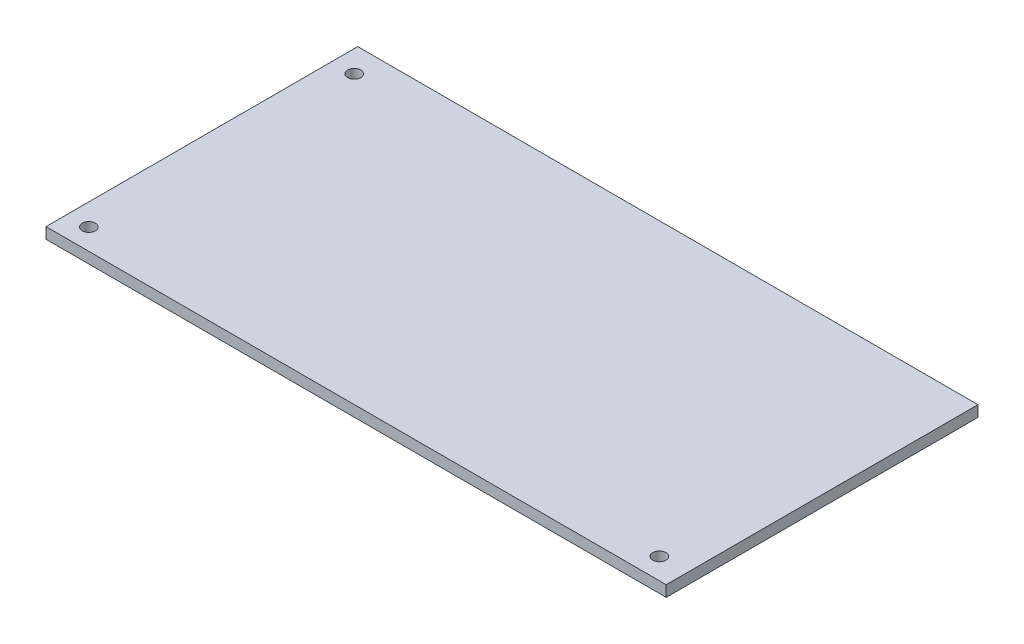
ISO-10303-21;
HEADER;
FILE_DESCRIPTION(('STEP AP214'),'2;1');
FILE_NAME('part.step','',(''),(''),'','','');
FILE_SCHEMA(('AUTOMOTIVE_DESIGN { 1 0 10303 214 1 1 1 1 }'));
ENDSEC;
DATA;
#1=APPLICATION_CONTEXT('core data for automotive mechanical design processes');
#2=APPLICATION_PROTOCOL_DEFINITION('international standard','automotive_design',2000,#1);
#3=PRODUCT_CONTEXT('',#1,'mechanical');
#4=PRODUCT('Part','Part','',(#3));
#5=PRODUCT_RELATED_PRODUCT_CATEGORY('part','',(#4));
#6=PRODUCT_DEFINITION_FORMATION('','',#4);
#7=PRODUCT_DEFINITION_CONTEXT('part definition',#1,'design');
#8=PRODUCT_DEFINITION('design','',#6,#7);
#9=PRODUCT_DEFINITION_SHAPE('','',#8);
#10=(LENGTH_UNIT() NAMED_UNIT(*) SI_UNIT(.MILLI.,.METRE.));
#11=(NAMED_UNIT(*) PLANE_ANGLE_UNIT() SI_UNIT($,.RADIAN.));
#12=(NAMED_UNIT(*) SI_UNIT($,.STERADIAN.) SOLID_ANGLE_UNIT());
#13=UNCERTAINTY_MEASURE_WITH_UNIT(LENGTH_MEASURE(1.E-05),#10,'distance_accuracy_value','');
#14=(GEOMETRIC_REPRESENTATION_CONTEXT(3) GLOBAL_UNCERTAINTY_ASSIGNED_CONTEXT((#13)) GLOBAL_UNIT_ASSIGNED_CONTEXT((#10,
#11,#12)) REPRESENTATION_CONTEXT('',''));
#15=CARTESIAN_POINT('',(0.,0.,0.));
#16=DIRECTION('',(0.,0.,1.));
#17=DIRECTION('',(1.,0.,0.));
#18=AXIS2_PLACEMENT_3D('',#15,#16,#17);
#19=CARTESIAN_POINT('',(0.,1.66,0.));
#20=DIRECTION('',(1.,0.,0.));
#21=DIRECTION('',(0.,0.,-1.));
#22=AXIS2_PLACEMENT_3D('',#19,#20,#21);
#23=PLANE('',#22);
#24=DIRECTION('',(0.,0.,1.));
#25=VECTOR('',#24,1.);
#26=CARTESIAN_POINT('',(0.,0.,0.));
#27=LINE('',#26,#25);
#28=CARTESIAN_POINT('',(0.,0.,-47.));
#29=VERTEX_POINT('',#28);
#30=CARTESIAN_POINT('',(0.,0.,0.));
#31=VERTEX_POINT('',#30);
#32=EDGE_CURVE('E97',#29,#31,#27,.T.);
#33=ORIENTED_EDGE('',*,*,#32,.T.);
#34=DIRECTION('',(0.,-1.,0.));
#35=VECTOR('',#34,1.);
#36=CARTESIAN_POINT('',(0.,1.66,0.));
#37=LINE('',#36,#35);
#38=CARTESIAN_POINT('',(0.,1.66,0.));
#39=VERTEX_POINT('',#38);
#40=EDGE_CURVE('E11',#39,#31,#37,.T.);
#41=ORIENTED_EDGE('',*,*,#40,.F.);
#42=DIRECTION('',(0.,0.,1.));
#43=VECTOR('',#42,1.);
#44=CARTESIAN_POINT('',(0.,1.66,0.));
#45=LINE('',#44,#43);
#46=CARTESIAN_POINT('',(0.,1.66,-47.));
#47=VERTEX_POINT('',#46);
#48=EDGE_CURVE('E85',#47,#39,#45,.T.);
#49=ORIENTED_EDGE('',*,*,#48,.F.);
#50=DIRECTION('',(0.,-1.,0.));
#51=VECTOR('',#50,1.);
#52=CARTESIAN_POINT('',(0.,1.66,-47.));
#53=LINE('',#52,#51);
#54=EDGE_CURVE('E93',#47,#29,#53,.T.);
#55=ORIENTED_EDGE('',*,*,#54,.T.);
#56=EDGE_LOOP('',(#33,#41,#49,#55));
#57=FACE_BOUND('',#56,.T.);
#58=ADVANCED_FACE('F34',(#57),#23,.F.);
#59=CARTESIAN_POINT('',(0.,1.66,0.));
#60=DIRECTION('',(0.,0.,-1.));
#61=DIRECTION('',(-1.,0.,0.));
#62=AXIS2_PLACEMENT_3D('',#59,#60,#61);
#63=PLANE('',#62);
#64=DIRECTION('',(1.,0.,0.));
#65=VECTOR('',#64,1.);
#66=CARTESIAN_POINT('',(0.,0.,0.));
#67=LINE('',#66,#65);
#68=CARTESIAN_POINT('',(93.5,0.,0.));
#69=VERTEX_POINT('',#68);
#70=EDGE_CURVE('E89',#31,#69,#67,.T.);
#71=ORIENTED_EDGE('',*,*,#70,.T.);
#72=DIRECTION('',(0.,-1.,0.));
#73=VECTOR('',#72,1.);
#74=CARTESIAN_POINT('',(93.5,1.66,0.));
#75=LINE('',#74,#73);
#76=CARTESIAN_POINT('',(93.5,1.66,0.));
#77=VERTEX_POINT('',#76);
#78=EDGE_CURVE('E42',#77,#69,#75,.T.);
#79=ORIENTED_EDGE('',*,*,#78,.F.);
#80=DIRECTION('',(1.,0.,0.));
#81=VECTOR('',#80,1.);
#82=CARTESIAN_POINT('',(0.,1.66,0.));
#83=LINE('',#82,#81);
#84=EDGE_CURVE('E80',#39,#77,#83,.T.);
#85=ORIENTED_EDGE('',*,*,#84,.F.);
#86=ORIENTED_EDGE('',*,*,#40,.T.);
#87=EDGE_LOOP('',(#71,#79,#85,#86));
#88=FACE_BOUND('',#87,.T.);
#89=ADVANCED_FACE('F88',(#88),#63,.F.);
#90=CARTESIAN_POINT('',(93.5,1.66,0.));
#91=DIRECTION('',(-1.,0.,0.));
#92=DIRECTION('',(0.,0.,1.));
#93=AXIS2_PLACEMENT_3D('',#90,#91,#92);
#94=PLANE('',#93);
#95=DIRECTION('',(0.,0.,-1.));
#96=VECTOR('',#95,1.);
#97=CARTESIAN_POINT('',(93.5,0.,0.));
#98=LINE('',#97,#96);
#99=CARTESIAN_POINT('',(93.5,0.,-47.));
#100=VERTEX_POINT('',#99);
#101=EDGE_CURVE('E67',#69,#100,#98,.T.);
#102=ORIENTED_EDGE('',*,*,#101,.T.);
#103=DIRECTION('',(0.,-1.,0.));
#104=VECTOR('',#103,1.);
#105=CARTESIAN_POINT('',(93.5,1.66,-47.));
#106=LINE('',#105,#104);
#107=CARTESIAN_POINT('',(93.5,1.66,-47.));
#108=VERTEX_POINT('',#107);
#109=EDGE_CURVE('E90',#108,#100,#106,.T.);
#110=ORIENTED_EDGE('',*,*,#109,.F.);
#111=DIRECTION('',(0.,0.,-1.));
#112=VECTOR('',#111,1.);
#113=CARTESIAN_POINT('',(93.5,1.66,0.));
#114=LINE('',#113,#112);
#115=EDGE_CURVE('E83',#77,#108,#114,.T.);
#116=ORIENTED_EDGE('',*,*,#115,.F.);
#117=ORIENTED_EDGE('',*,*,#78,.T.);
#118=EDGE_LOOP('',(#102,#110,#116,#117));
#119=FACE_BOUND('',#118,.T.);
#120=ADVANCED_FACE('F91',(#119),#94,.F.);
#121=CARTESIAN_POINT('',(0.,1.66,-47.));
#122=DIRECTION('',(0.,0.,1.));
#123=DIRECTION('',(1.,0.,0.));
#124=AXIS2_PLACEMENT_3D('',#121,#122,#123);
#125=PLANE('',#124);
#126=DIRECTION('',(-1.,0.,0.));
#127=VECTOR('',#126,1.);
#128=CARTESIAN_POINT('',(0.,0.,-47.));
#129=LINE('',#128,#127);
#130=EDGE_CURVE('E73',#100,#29,#129,.T.);
#131=ORIENTED_EDGE('',*,*,#130,.T.);
#132=ORIENTED_EDGE('',*,*,#54,.F.);
#133=DIRECTION('',(-1.,0.,0.));
#134=VECTOR('',#133,1.);
#135=CARTESIAN_POINT('',(0.,1.66,-47.));
#136=LINE('',#135,#134);
#137=EDGE_CURVE('E50',#108,#47,#136,.T.);
#138=ORIENTED_EDGE('',*,*,#137,.F.);
#139=ORIENTED_EDGE('',*,*,#109,.T.);
#140=EDGE_LOOP('',(#131,#132,#138,#139));
#141=FACE_BOUND('',#140,.T.);
#142=ADVANCED_FACE('F105',(#141),#125,.F.);
#143=CARTESIAN_POINT('',(0.,1.66,-47.));
#144=DIRECTION('',(0.,-1.,0.));
#145=DIRECTION('',(0.,0.,-1.));
#146=AXIS2_PLACEMENT_3D('',#143,#144,#145);
#147=PLANE('',#146);
#148=CARTESIAN_POINT('',(3.28381151936868,1.66,-3.17974534546621));
#149=DIRECTION('',(0.,1.,0.));
#150=DIRECTION('',(0.,0.,1.));
#151=AXIS2_PLACEMENT_3D('',#148,#149,#150);
#152=CIRCLE('',#151,1.);
#153=CARTESIAN_POINT('',(3.28381151936868,1.66,-2.17974534546621));
#154=VERTEX_POINT('',#153);
#155=EDGE_CURVE('E123',#154,#154,#152,.T.);
#156=ORIENTED_EDGE('',*,*,#155,.F.);
#157=EDGE_LOOP('',(#156));
#158=FACE_BOUND('',#157,.T.);
#159=CARTESIAN_POINT('',(89.2838115193687,1.66,-3.17974534546621));
#160=DIRECTION('',(0.,1.,0.));
#161=DIRECTION('',(0.,0.,1.));
#162=AXIS2_PLACEMENT_3D('',#159,#160,#161);
#163=CIRCLE('',#162,0.999999999999998);
#164=CARTESIAN_POINT('',(89.2838115193687,1.66,-2.17974534546622));
#165=VERTEX_POINT('',#164);
#166=EDGE_CURVE('E117',#165,#165,#163,.T.);
#167=ORIENTED_EDGE('',*,*,#166,.F.);
#168=EDGE_LOOP('',(#167));
#169=FACE_BOUND('',#168,.T.);
#170=CARTESIAN_POINT('',(3.28381151936868,1.66,-43.1797453454662));
#171=DIRECTION('',(0.,1.,0.));
#172=DIRECTION('',(0.,0.,1.));
#173=AXIS2_PLACEMENT_3D('',#170,#171,#172);
#174=CIRCLE('',#173,1.);
#175=CARTESIAN_POINT('',(3.28381151936868,1.66,-42.1797453454662));
#176=VERTEX_POINT('',#175);
#177=EDGE_CURVE('E111',#176,#176,#174,.T.);
#178=ORIENTED_EDGE('',*,*,#177,.F.);
#179=EDGE_LOOP('',(#178));
#180=FACE_BOUND('',#179,.T.);
#181=ORIENTED_EDGE('',*,*,#48,.T.);
#182=ORIENTED_EDGE('',*,*,#84,.T.);
#183=ORIENTED_EDGE('',*,*,#115,.T.);
#184=ORIENTED_EDGE('',*,*,#137,.T.);
#185=EDGE_LOOP('',(#181,#182,#183,#184));
#186=FACE_BOUND('',#185,.T.);
#187=ADVANCED_FACE('F81',(#158,#169,#180,#186),#147,.F.);
#188=CARTESIAN_POINT('',(0.,0.,-47.));
#189=DIRECTION('',(0.,-1.,0.));
#190=DIRECTION('',(0.,0.,-1.));
#191=AXIS2_PLACEMENT_3D('',#188,#189,#190);
#192=PLANE('',#191);
#193=CARTESIAN_POINT('',(3.28381151936868,0.,-3.17974534546621));
#194=DIRECTION('',(0.,1.,0.));
#195=DIRECTION('',(0.,0.,1.));
#196=AXIS2_PLACEMENT_3D('',#193,#194,#195);
#197=CIRCLE('',#196,1.);
#198=CARTESIAN_POINT('',(3.28381151936868,0.,-2.17974534546621));
#199=VERTEX_POINT('',#198);
#200=EDGE_CURVE('E120',#199,#199,#197,.T.);
#201=ORIENTED_EDGE('',*,*,#200,.T.);
#202=EDGE_LOOP('',(#201));
#203=FACE_BOUND('',#202,.T.);
#204=CARTESIAN_POINT('',(89.2838115193687,0.,-3.17974534546621));
#205=DIRECTION('',(0.,1.,0.));
#206=DIRECTION('',(0.,0.,1.));
#207=AXIS2_PLACEMENT_3D('',#204,#205,#206);
#208=CIRCLE('',#207,0.999999999999998);
#209=CARTESIAN_POINT('',(89.2838115193687,0.,-2.17974534546622));
#210=VERTEX_POINT('',#209);
#211=EDGE_CURVE('E114',#210,#210,#208,.T.);
#212=ORIENTED_EDGE('',*,*,#211,.T.);
#213=EDGE_LOOP('',(#212));
#214=FACE_BOUND('',#213,.T.);
#215=CARTESIAN_POINT('',(3.28381151936868,0.,-43.1797453454662));
#216=DIRECTION('',(0.,1.,0.));
#217=DIRECTION('',(0.,0.,1.));
#218=AXIS2_PLACEMENT_3D('',#215,#216,#217);
#219=CIRCLE('',#218,1.);
#220=CARTESIAN_POINT('',(3.28381151936868,0.,-42.1797453454662));
#221=VERTEX_POINT('',#220);
#222=EDGE_CURVE('E100',#221,#221,#219,.T.);
#223=ORIENTED_EDGE('',*,*,#222,.T.);
#224=EDGE_LOOP('',(#223));
#225=FACE_BOUND('',#224,.T.);
#226=ORIENTED_EDGE('',*,*,#32,.F.);
#227=ORIENTED_EDGE('',*,*,#130,.F.);
#228=ORIENTED_EDGE('',*,*,#101,.F.);
#229=ORIENTED_EDGE('',*,*,#70,.F.);
#230=EDGE_LOOP('',(#226,#227,#228,#229));
#231=FACE_BOUND('',#230,.T.);
#232=ADVANCED_FACE('F108',(#203,#214,#225,#231),#192,.T.);
#233=CARTESIAN_POINT('',(3.28381151936868,0.,-43.1797453454662));
#234=DIRECTION('',(0.,1.,0.));
#235=DIRECTION('',(0.,0.,1.));
#236=AXIS2_PLACEMENT_3D('',#233,#234,#235);
#237=CYLINDRICAL_SURFACE('',#236,1.);
#238=ORIENTED_EDGE('',*,*,#222,.F.);
#239=EDGE_LOOP('',(#238));
#240=FACE_BOUND('',#239,.T.);
#241=ORIENTED_EDGE('',*,*,#177,.T.);
#242=EDGE_LOOP('',(#241));
#243=FACE_BOUND('',#242,.T.);
#244=ADVANCED_FACE('F145',(#240,#243),#237,.F.);
#245=CARTESIAN_POINT('',(89.2838115193687,0.,-3.17974534546621));
#246=DIRECTION('',(0.,1.,0.));
#247=DIRECTION('',(0.,0.,1.));
#248=AXIS2_PLACEMENT_3D('',#245,#246,#247);
#249=CYLINDRICAL_SURFACE('',#248,0.999999999999998);
#250=ORIENTED_EDGE('',*,*,#211,.F.);
#251=EDGE_LOOP('',(#250));
#252=FACE_BOUND('',#251,.T.);
#253=ORIENTED_EDGE('',*,*,#166,.T.);
#254=EDGE_LOOP('',(#253));
#255=FACE_BOUND('',#254,.T.);
#256=ADVANCED_FACE('F134',(#252,#255),#249,.F.);
#257=CARTESIAN_POINT('',(3.28381151936868,0.,-3.17974534546621));
#258=DIRECTION('',(0.,1.,0.));
#259=DIRECTION('',(0.,0.,1.));
#260=AXIS2_PLACEMENT_3D('',#257,#258,#259);
#261=CYLINDRICAL_SURFACE('',#260,1.);
#262=ORIENTED_EDGE('',*,*,#200,.F.);
#263=EDGE_LOOP('',(#262));
#264=FACE_BOUND('',#263,.T.);
#265=ORIENTED_EDGE('',*,*,#155,.T.);
#266=EDGE_LOOP('',(#265));
#267=FACE_BOUND('',#266,.T.);
#268=ADVANCED_FACE('F131',(#264,#267),#261,.F.);
#269=CLOSED_SHELL('',(#58,#89,#120,#142,#187,#232,#244,#256,#268));
#270=MANIFOLD_SOLID_BREP('B2',#269);
#271=ADVANCED_BREP_SHAPE_REPRESENTATION('',(#18,#270),#14);
#272=SHAPE_DEFINITION_REPRESENTATION(#9,#271);
ENDSEC;
END-ISO-10303-21;
